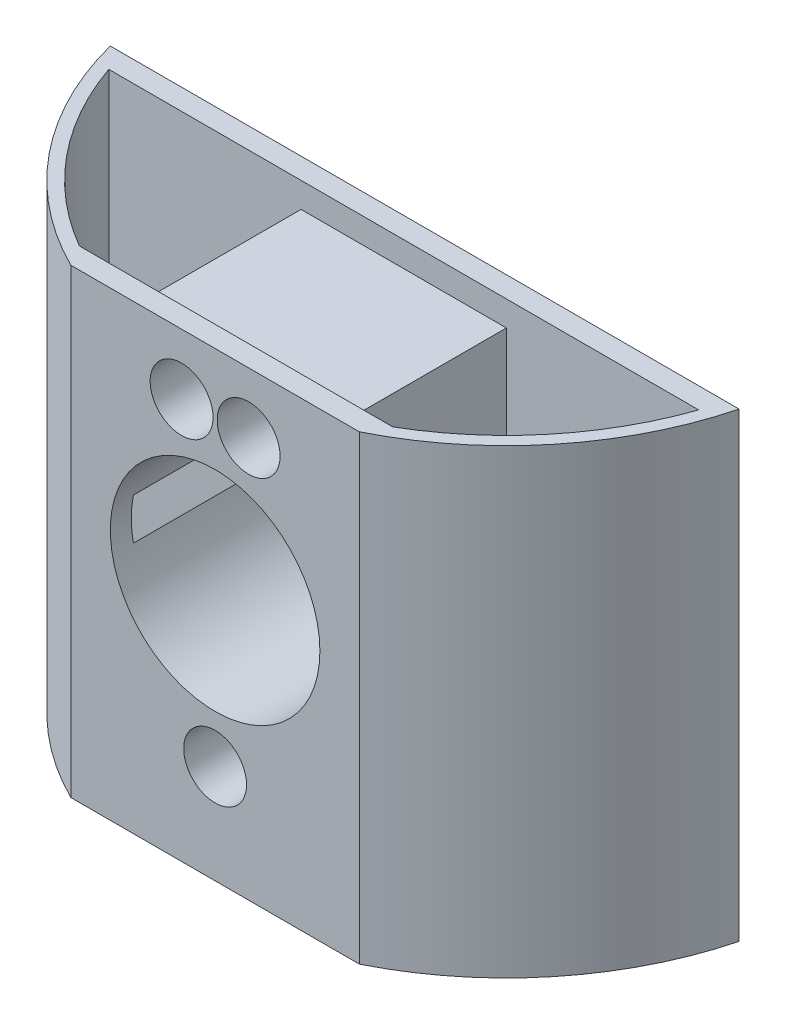
ISO-10303-21;
HEADER;
FILE_DESCRIPTION(('STEP AP214'),'2;1');
FILE_NAME('part.step','',(''),(''),'','','');
FILE_SCHEMA(('AUTOMOTIVE_DESIGN { 1 0 10303 214 1 1 1 1 }'));
ENDSEC;
DATA;
#1=APPLICATION_CONTEXT('core data for automotive mechanical design processes');
#2=APPLICATION_PROTOCOL_DEFINITION('international standard','automotive_design',2000,#1);
#3=PRODUCT_CONTEXT('',#1,'mechanical');
#4=PRODUCT('Part','Part','',(#3));
#5=PRODUCT_RELATED_PRODUCT_CATEGORY('part','',(#4));
#6=PRODUCT_DEFINITION_FORMATION('','',#4);
#7=PRODUCT_DEFINITION_CONTEXT('part definition',#1,'design');
#8=PRODUCT_DEFINITION('design','',#6,#7);
#9=PRODUCT_DEFINITION_SHAPE('','',#8);
#10=(LENGTH_UNIT() NAMED_UNIT(*) SI_UNIT(.MILLI.,.METRE.));
#11=(NAMED_UNIT(*) PLANE_ANGLE_UNIT() SI_UNIT($,.RADIAN.));
#12=(NAMED_UNIT(*) SI_UNIT($,.STERADIAN.) SOLID_ANGLE_UNIT());
#13=UNCERTAINTY_MEASURE_WITH_UNIT(LENGTH_MEASURE(1.E-05),#10,'distance_accuracy_value','');
#14=(GEOMETRIC_REPRESENTATION_CONTEXT(3) GLOBAL_UNCERTAINTY_ASSIGNED_CONTEXT((#13)) GLOBAL_UNIT_ASSIGNED_CONTEXT((#10,
#11,#12)) REPRESENTATION_CONTEXT('',''));
#15=CARTESIAN_POINT('',(0.,0.,0.));
#16=DIRECTION('',(0.,0.,1.));
#17=DIRECTION('',(1.,0.,0.));
#18=AXIS2_PLACEMENT_3D('',#15,#16,#17);
#19=CARTESIAN_POINT('',(0.,31.75,0.));
#20=DIRECTION('',(0.,1.,0.));
#21=DIRECTION('',(-1.,0.,0.));
#22=AXIS2_PLACEMENT_3D('',#19,#20,#21);
#23=PLANE('',#22);
#24=CARTESIAN_POINT('',(0.,31.75,-12.3444));
#25=DIRECTION('',(0.,1.,0.));
#26=DIRECTION('',(-1.,0.,0.));
#27=AXIS2_PLACEMENT_3D('',#24,#25,#26);
#28=CIRCLE('',#27,49.2125);
#29=CARTESIAN_POINT('',(-21.853009973228,31.75,31.75));
#30=VERTEX_POINT('',#29);
#31=CARTESIAN_POINT('',(-47.6391219995709,31.75,0.));
#32=VERTEX_POINT('',#31);
#33=EDGE_CURVE('E249',#30,#32,#28,.F.);
#34=ORIENTED_EDGE('',*,*,#33,.F.);
#35=DIRECTION('',(-1.,0.,0.));
#36=VECTOR('',#35,1.);
#37=CARTESIAN_POINT('',(0.,31.75,31.75));
#38=LINE('',#37,#36);
#39=CARTESIAN_POINT('',(21.853009973228,31.75,31.75));
#40=VERTEX_POINT('',#39);
#41=EDGE_CURVE('E293',#40,#30,#38,.T.);
#42=ORIENTED_EDGE('',*,*,#41,.F.);
#43=CARTESIAN_POINT('',(0.,31.75,-12.3444));
#44=DIRECTION('',(0.,1.,0.));
#45=DIRECTION('',(-1.,0.,0.));
#46=AXIS2_PLACEMENT_3D('',#43,#44,#45);
#47=CIRCLE('',#46,49.2125);
#48=CARTESIAN_POINT('',(47.6391219995709,31.75,0.));
#49=VERTEX_POINT('',#48);
#50=EDGE_CURVE('E240',#40,#49,#47,.T.);
#51=ORIENTED_EDGE('',*,*,#50,.T.);
#52=DIRECTION('',(-1.,0.,0.));
#53=VECTOR('',#52,1.);
#54=CARTESIAN_POINT('',(0.,31.75,0.));
#55=LINE('',#54,#53);
#56=EDGE_CURVE('E297',#49,#32,#55,.T.);
#57=ORIENTED_EDGE('',*,*,#56,.T.);
#58=EDGE_LOOP('',(#34,#42,#51,#57));
#59=FACE_BOUND('',#58,.T.);
#60=DIRECTION('',(-1.,0.,0.));
#61=VECTOR('',#60,1.);
#62=CARTESIAN_POINT('',(-44.6894593823868,31.75,3.175));
#63=LINE('',#62,#61);
#64=CARTESIAN_POINT('',(44.6894593823868,31.75,3.175));
#65=VERTEX_POINT('',#64);
#66=CARTESIAN_POINT('',(-44.6894593823868,31.75,3.175));
#67=VERTEX_POINT('',#66);
#68=EDGE_CURVE('E219',#65,#67,#63,.T.);
#69=ORIENTED_EDGE('',*,*,#68,.F.);
#70=CARTESIAN_POINT('',(0.,31.75,-12.3444));
#71=DIRECTION('',(0.,-1.,0.));
#72=DIRECTION('',(-1.,0.,0.));
#73=AXIS2_PLACEMENT_3D('',#70,#71,#72);
#74=CIRCLE('',#73,47.3075);
#75=CARTESIAN_POINT('',(23.7403087572593,31.75,28.575));
#76=VERTEX_POINT('',#75);
#77=EDGE_CURVE('E165',#65,#76,#74,.T.);
#78=ORIENTED_EDGE('',*,*,#77,.T.);
#79=DIRECTION('',(1.,0.,0.));
#80=VECTOR('',#79,1.);
#81=CARTESIAN_POINT('',(-15.5575,31.75,28.575));
#82=LINE('',#81,#80);
#83=CARTESIAN_POINT('',(-23.7403087572593,31.75,28.575));
#84=VERTEX_POINT('',#83);
#85=EDGE_CURVE('E58',#84,#76,#82,.T.);
#86=ORIENTED_EDGE('',*,*,#85,.F.);
#87=CARTESIAN_POINT('',(0.,31.75,-12.3444));
#88=DIRECTION('',(0.,1.,0.));
#89=DIRECTION('',(1.,0.,0.));
#90=AXIS2_PLACEMENT_3D('',#87,#88,#89);
#91=CIRCLE('',#90,47.3075);
#92=EDGE_CURVE('E213',#67,#84,#91,.T.);
#93=ORIENTED_EDGE('',*,*,#92,.F.);
#94=EDGE_LOOP('',(#69,#78,#86,#93));
#95=FACE_BOUND('',#94,.T.);
#96=ADVANCED_FACE('F42',(#59,#95),#23,.T.);
#97=CARTESIAN_POINT('',(-15.5575,-76.7501107043309,3.175));
#98=DIRECTION('',(1.,0.,0.));
#99=DIRECTION('',(0.,1.,0.));
#100=AXIS2_PLACEMENT_3D('',#97,#98,#99);
#101=PLANE('',#100);
#102=DIRECTION('',(0.,0.,-1.));
#103=VECTOR('',#102,1.);
#104=CARTESIAN_POINT('',(-15.5575,27.94,59.9223974198816));
#105=LINE('',#104,#103);
#106=CARTESIAN_POINT('',(-15.5575,27.94,28.575));
#107=VERTEX_POINT('',#106);
#108=CARTESIAN_POINT('',(-15.5575,27.94,3.175));
#109=VERTEX_POINT('',#108);
#110=EDGE_CURVE('E161',#107,#109,#105,.T.);
#111=ORIENTED_EDGE('',*,*,#110,.T.);
#112=DIRECTION('',(0.,1.,0.));
#113=VECTOR('',#112,1.);
#114=CARTESIAN_POINT('',(-15.5575,-76.7501107043309,3.175));
#115=LINE('',#114,#113);
#116=CARTESIAN_POINT('',(-15.5575,3.15908511281351,3.175));
#117=VERTEX_POINT('',#116);
#118=EDGE_CURVE('E230',#117,#109,#115,.T.);
#119=ORIENTED_EDGE('',*,*,#118,.F.);
#120=DIRECTION('',(0.,0.,1.));
#121=VECTOR('',#120,1.);
#122=CARTESIAN_POINT('',(-15.5575,3.15908511281352,0.));
#123=LINE('',#122,#121);
#124=CARTESIAN_POINT('',(-15.5575,3.15908511281353,28.575));
#125=VERTEX_POINT('',#124);
#126=EDGE_CURVE('E322',#125,#117,#123,.F.);
#127=ORIENTED_EDGE('',*,*,#126,.F.);
#128=DIRECTION('',(0.,1.,0.));
#129=VECTOR('',#128,1.);
#130=CARTESIAN_POINT('',(-15.5575,-76.7501107043309,28.575));
#131=LINE('',#130,#129);
#132=EDGE_CURVE('E235',#125,#107,#131,.T.);
#133=ORIENTED_EDGE('',*,*,#132,.T.);
#134=EDGE_LOOP('',(#111,#119,#127,#133));
#135=FACE_BOUND('',#134,.T.);
#136=ADVANCED_FACE('F377',(#135),#101,.F.);
#137=CARTESIAN_POINT('',(15.5575,-76.7501107043309,3.175));
#138=DIRECTION('',(1.,0.,0.));
#139=DIRECTION('',(0.,1.,0.));
#140=AXIS2_PLACEMENT_3D('',#137,#138,#139);
#141=PLANE('',#140);
#142=DIRECTION('',(0.,1.,0.));
#143=VECTOR('',#142,1.);
#144=CARTESIAN_POINT('',(15.5575,-76.7501107043309,3.175));
#145=LINE('',#144,#143);
#146=CARTESIAN_POINT('',(15.5575,3.1590851128135,3.175));
#147=VERTEX_POINT('',#146);
#148=CARTESIAN_POINT('',(15.5575,27.94,3.175));
#149=VERTEX_POINT('',#148);
#150=EDGE_CURVE('E174',#147,#149,#145,.T.);
#151=ORIENTED_EDGE('',*,*,#150,.T.);
#152=DIRECTION('',(0.,0.,-1.));
#153=VECTOR('',#152,1.);
#154=CARTESIAN_POINT('',(15.5575,27.94,59.9223974198816));
#155=LINE('',#154,#153);
#156=CARTESIAN_POINT('',(15.5575,27.94,28.575));
#157=VERTEX_POINT('',#156);
#158=EDGE_CURVE('E158',#157,#149,#155,.T.);
#159=ORIENTED_EDGE('',*,*,#158,.F.);
#160=DIRECTION('',(0.,1.,0.));
#161=VECTOR('',#160,1.);
#162=CARTESIAN_POINT('',(15.5575,-76.7501107043309,28.575));
#163=LINE('',#162,#161);
#164=CARTESIAN_POINT('',(15.5575,3.15908511281355,28.575));
#165=VERTEX_POINT('',#164);
#166=EDGE_CURVE('E171',#165,#157,#163,.T.);
#167=ORIENTED_EDGE('',*,*,#166,.F.);
#168=DIRECTION('',(0.,0.,1.));
#169=VECTOR('',#168,1.);
#170=CARTESIAN_POINT('',(15.5575,3.15908511281353,0.));
#171=LINE('',#170,#169);
#172=EDGE_CURVE('E51',#165,#147,#171,.F.);
#173=ORIENTED_EDGE('',*,*,#172,.T.);
#174=EDGE_LOOP('',(#151,#159,#167,#173));
#175=FACE_BOUND('',#174,.T.);
#176=ADVANCED_FACE('F170',(#175),#141,.T.);
#177=CARTESIAN_POINT('',(0.,0.,0.));
#178=DIRECTION('',(0.,0.,1.));
#179=DIRECTION('',(1.,0.,0.));
#180=AXIS2_PLACEMENT_3D('',#177,#178,#179);
#181=CYLINDRICAL_SURFACE('',#180,15.875);
#182=CARTESIAN_POINT('',(0.,0.,31.75));
#183=DIRECTION('',(0.,0.,1.));
#184=DIRECTION('',(1.,0.,0.));
#185=AXIS2_PLACEMENT_3D('',#182,#183,#184);
#186=CIRCLE('',#185,15.875);
#187=CARTESIAN_POINT('',(15.875,0.,31.75));
#188=VERTEX_POINT('',#187);
#189=EDGE_CURVE('E274',#188,#188,#186,.T.);
#190=ORIENTED_EDGE('',*,*,#189,.T.);
#191=EDGE_LOOP('',(#190));
#192=FACE_BOUND('',#191,.T.);
#193=CARTESIAN_POINT('',(0.,0.,0.));
#194=DIRECTION('',(0.,0.,1.));
#195=DIRECTION('',(1.,0.,0.));
#196=AXIS2_PLACEMENT_3D('',#193,#194,#195);
#197=CIRCLE('',#196,15.875);
#198=CARTESIAN_POINT('',(15.875,0.,0.));
#199=VERTEX_POINT('',#198);
#200=EDGE_CURVE('E254',#199,#199,#197,.T.);
#201=ORIENTED_EDGE('',*,*,#200,.F.);
#202=EDGE_LOOP('',(#201));
#203=FACE_BOUND('',#202,.T.);
#204=ORIENTED_EDGE('',*,*,#126,.T.);
#205=CARTESIAN_POINT('',(0.,0.,3.175));
#206=DIRECTION('',(0.,0.,-1.));
#207=DIRECTION('',(-1.,0.,0.));
#208=AXIS2_PLACEMENT_3D('',#205,#206,#207);
#209=CIRCLE('',#208,15.875);
#210=CARTESIAN_POINT('',(-15.5575,-3.15908511281353,3.175));
#211=VERTEX_POINT('',#210);
#212=EDGE_CURVE('E326',#117,#211,#209,.F.);
#213=ORIENTED_EDGE('',*,*,#212,.T.);
#214=DIRECTION('',(0.,0.,1.));
#215=VECTOR('',#214,1.);
#216=CARTESIAN_POINT('',(-15.5575,-3.15908511281352,0.));
#217=LINE('',#216,#215);
#218=CARTESIAN_POINT('',(-15.5575,-3.15908511281354,28.575));
#219=VERTEX_POINT('',#218);
#220=EDGE_CURVE('E318',#211,#219,#217,.T.);
#221=ORIENTED_EDGE('',*,*,#220,.T.);
#222=CARTESIAN_POINT('',(0.,0.,28.575));
#223=DIRECTION('',(0.,0.,1.));
#224=DIRECTION('',(1.,0.,0.));
#225=AXIS2_PLACEMENT_3D('',#222,#223,#224);
#226=CIRCLE('',#225,15.875);
#227=EDGE_CURVE('E314',#219,#125,#226,.F.);
#228=ORIENTED_EDGE('',*,*,#227,.T.);
#229=EDGE_LOOP('',(#204,#213,#221,#228));
#230=FACE_BOUND('',#229,.T.);
#231=CARTESIAN_POINT('',(0.,0.,3.175));
#232=DIRECTION('',(0.,0.,1.));
#233=DIRECTION('',(1.,0.,0.));
#234=AXIS2_PLACEMENT_3D('',#231,#232,#233);
#235=CIRCLE('',#234,15.875);
#236=CARTESIAN_POINT('',(15.5575,-3.15908511281357,3.175));
#237=VERTEX_POINT('',#236);
#238=EDGE_CURVE('E13',#147,#237,#235,.F.);
#239=ORIENTED_EDGE('',*,*,#238,.F.);
#240=ORIENTED_EDGE('',*,*,#172,.F.);
#241=CARTESIAN_POINT('',(0.,0.,28.575));
#242=DIRECTION('',(0.,0.,-1.));
#243=DIRECTION('',(-1.,0.,0.));
#244=AXIS2_PLACEMENT_3D('',#241,#242,#243);
#245=CIRCLE('',#244,15.875);
#246=CARTESIAN_POINT('',(15.5575,-3.15908511281356,28.575));
#247=VERTEX_POINT('',#246);
#248=EDGE_CURVE('E181',#247,#165,#245,.F.);
#249=ORIENTED_EDGE('',*,*,#248,.F.);
#250=DIRECTION('',(0.,0.,1.));
#251=VECTOR('',#250,1.);
#252=CARTESIAN_POINT('',(15.5575,-3.15908511281354,0.));
#253=LINE('',#252,#251);
#254=EDGE_CURVE('E332',#237,#247,#253,.T.);
#255=ORIENTED_EDGE('',*,*,#254,.F.);
#256=EDGE_LOOP('',(#239,#240,#249,#255));
#257=FACE_BOUND('',#256,.T.);
#258=ADVANCED_FACE('F343',(#192,#203,#230,#257),#181,.F.);
#259=CARTESIAN_POINT('',(0.,0.,31.75));
#260=DIRECTION('',(0.,0.,1.));
#261=DIRECTION('',(1.,0.,0.));
#262=AXIS2_PLACEMENT_3D('',#259,#260,#261);
#263=PLANE('',#262);
#264=ORIENTED_EDGE('',*,*,#189,.F.);
#265=EDGE_LOOP('',(#264));
#266=FACE_BOUND('',#265,.T.);
#267=CARTESIAN_POINT('',(0.,-23.114,31.75));
#268=DIRECTION('',(0.,0.,1.));
#269=DIRECTION('',(1.,0.,0.));
#270=AXIS2_PLACEMENT_3D('',#267,#268,#269);
#271=CIRCLE('',#270,4.7625);
#272=CARTESIAN_POINT('',(4.7625,-23.114,31.75));
#273=VERTEX_POINT('',#272);
#274=EDGE_CURVE('E267',#273,#273,#271,.T.);
#275=ORIENTED_EDGE('',*,*,#274,.F.);
#276=EDGE_LOOP('',(#275));
#277=FACE_BOUND('',#276,.T.);
#278=CARTESIAN_POINT('',(-5.08,22.5488491058857,31.75));
#279=DIRECTION('',(0.,0.,1.));
#280=DIRECTION('',(1.,0.,0.));
#281=AXIS2_PLACEMENT_3D('',#278,#279,#280);
#282=CIRCLE('',#281,4.7625);
#283=CARTESIAN_POINT('',(-0.317500000000002,22.5488491058857,31.75));
#284=VERTEX_POINT('',#283);
#285=EDGE_CURVE('E259',#284,#284,#282,.T.);
#286=ORIENTED_EDGE('',*,*,#285,.F.);
#287=EDGE_LOOP('',(#286));
#288=FACE_BOUND('',#287,.T.);
#289=CARTESIAN_POINT('',(5.08,22.5488491058857,31.75));
#290=DIRECTION('',(0.,0.,1.));
#291=DIRECTION('',(1.,0.,0.));
#292=AXIS2_PLACEMENT_3D('',#289,#290,#291);
#293=CIRCLE('',#292,4.7625);
#294=CARTESIAN_POINT('',(9.8425,22.5488491058857,31.75));
#295=VERTEX_POINT('',#294);
#296=EDGE_CURVE('E250',#295,#295,#293,.T.);
#297=ORIENTED_EDGE('',*,*,#296,.F.);
#298=EDGE_LOOP('',(#297));
#299=FACE_BOUND('',#298,.T.);
#300=DIRECTION('',(0.,1.,0.));
#301=VECTOR('',#300,1.);
#302=CARTESIAN_POINT('',(21.853009973228,-38.1000000000001,31.75));
#303=LINE('',#302,#301);
#304=CARTESIAN_POINT('',(21.853009973228,-38.1000000000001,31.75));
#305=VERTEX_POINT('',#304);
#306=EDGE_CURVE('E289',#305,#40,#303,.T.);
#307=ORIENTED_EDGE('',*,*,#306,.T.);
#308=ORIENTED_EDGE('',*,*,#41,.T.);
#309=DIRECTION('',(0.,1.,0.));
#310=VECTOR('',#309,1.);
#311=CARTESIAN_POINT('',(-21.853009973228,-38.1,31.75));
#312=LINE('',#311,#310);
#313=CARTESIAN_POINT('',(-21.853009973228,-38.1,31.75));
#314=VERTEX_POINT('',#313);
#315=EDGE_CURVE('E285',#314,#30,#312,.T.);
#316=ORIENTED_EDGE('',*,*,#315,.F.);
#317=DIRECTION('',(1.,0.,0.));
#318=VECTOR('',#317,1.);
#319=CARTESIAN_POINT('',(41.275,-38.1,31.75));
#320=LINE('',#319,#318);
#321=EDGE_CURVE('E245',#314,#305,#320,.T.);
#322=ORIENTED_EDGE('',*,*,#321,.T.);
#323=EDGE_LOOP('',(#307,#308,#316,#322));
#324=FACE_BOUND('',#323,.T.);
#325=ADVANCED_FACE('F412',(#266,#277,#288,#299,#324),#263,.T.);
#326=CARTESIAN_POINT('',(0.,0.,0.));
#327=DIRECTION('',(0.,0.,1.));
#328=DIRECTION('',(1.,0.,0.));
#329=AXIS2_PLACEMENT_3D('',#326,#327,#328);
#330=PLANE('',#329);
#331=CARTESIAN_POINT('',(5.08,22.5488491058857,0.));
#332=DIRECTION('',(0.,0.,1.));
#333=DIRECTION('',(1.,0.,0.));
#334=AXIS2_PLACEMENT_3D('',#331,#332,#333);
#335=CIRCLE('',#334,4.7625);
#336=CARTESIAN_POINT('',(9.8425,22.5488491058857,0.));
#337=VERTEX_POINT('',#336);
#338=EDGE_CURVE('E255',#337,#337,#335,.T.);
#339=ORIENTED_EDGE('',*,*,#338,.T.);
#340=EDGE_LOOP('',(#339));
#341=FACE_BOUND('',#340,.T.);
#342=CARTESIAN_POINT('',(-5.08,22.5488491058857,0.));
#343=DIRECTION('',(0.,0.,1.));
#344=DIRECTION('',(1.,0.,0.));
#345=AXIS2_PLACEMENT_3D('',#342,#343,#344);
#346=CIRCLE('',#345,4.7625);
#347=CARTESIAN_POINT('',(-0.317500000000002,22.5488491058857,0.));
#348=VERTEX_POINT('',#347);
#349=EDGE_CURVE('E263',#348,#348,#346,.T.);
#350=ORIENTED_EDGE('',*,*,#349,.T.);
#351=EDGE_LOOP('',(#350));
#352=FACE_BOUND('',#351,.T.);
#353=CARTESIAN_POINT('',(0.,-23.114,0.));
#354=DIRECTION('',(0.,0.,1.));
#355=DIRECTION('',(1.,0.,0.));
#356=AXIS2_PLACEMENT_3D('',#353,#354,#355);
#357=CIRCLE('',#356,4.7625);
#358=CARTESIAN_POINT('',(4.7625,-23.114,0.));
#359=VERTEX_POINT('',#358);
#360=EDGE_CURVE('E244',#359,#359,#357,.T.);
#361=ORIENTED_EDGE('',*,*,#360,.T.);
#362=EDGE_LOOP('',(#361));
#363=FACE_BOUND('',#362,.T.);
#364=ORIENTED_EDGE('',*,*,#200,.T.);
#365=EDGE_LOOP('',(#364));
#366=FACE_BOUND('',#365,.T.);
#367=ORIENTED_EDGE('',*,*,#56,.F.);
#368=DIRECTION('',(0.,1.,0.));
#369=VECTOR('',#368,1.);
#370=CARTESIAN_POINT('',(47.6391219995709,-38.1,0.));
#371=LINE('',#370,#369);
#372=CARTESIAN_POINT('',(47.6391219995709,-38.1,0.));
#373=VERTEX_POINT('',#372);
#374=EDGE_CURVE('E290',#373,#49,#371,.T.);
#375=ORIENTED_EDGE('',*,*,#374,.F.);
#376=DIRECTION('',(1.,0.,0.));
#377=VECTOR('',#376,1.);
#378=CARTESIAN_POINT('',(41.275,-38.1,0.));
#379=LINE('',#378,#377);
#380=CARTESIAN_POINT('',(-47.6391219995709,-38.1,0.));
#381=VERTEX_POINT('',#380);
#382=EDGE_CURVE('E241',#381,#373,#379,.T.);
#383=ORIENTED_EDGE('',*,*,#382,.F.);
#384=DIRECTION('',(0.,1.,0.));
#385=VECTOR('',#384,1.);
#386=CARTESIAN_POINT('',(-47.6391219995709,-38.1,0.));
#387=LINE('',#386,#385);
#388=EDGE_CURVE('E278',#381,#32,#387,.T.);
#389=ORIENTED_EDGE('',*,*,#388,.T.);
#390=EDGE_LOOP('',(#367,#375,#383,#389));
#391=FACE_BOUND('',#390,.T.);
#392=ADVANCED_FACE('F409',(#341,#352,#363,#366,#391),#330,.F.);
#393=CARTESIAN_POINT('',(0.,-38.1,-12.3444));
#394=DIRECTION('',(0.,1.,0.));
#395=DIRECTION('',(-1.,0.,0.));
#396=AXIS2_PLACEMENT_3D('',#393,#394,#395);
#397=CYLINDRICAL_SURFACE('',#396,49.2125);
#398=ORIENTED_EDGE('',*,*,#315,.T.);
#399=ORIENTED_EDGE('',*,*,#33,.T.);
#400=ORIENTED_EDGE('',*,*,#388,.F.);
#401=CARTESIAN_POINT('',(0.,-38.1,-12.3444));
#402=DIRECTION('',(0.,1.,0.));
#403=DIRECTION('',(-1.,0.,0.));
#404=AXIS2_PLACEMENT_3D('',#401,#402,#403);
#405=CIRCLE('',#404,49.2125);
#406=EDGE_CURVE('E282',#381,#314,#405,.T.);
#407=ORIENTED_EDGE('',*,*,#406,.T.);
#408=EDGE_LOOP('',(#398,#399,#400,#407));
#409=FACE_BOUND('',#408,.T.);
#410=ADVANCED_FACE('F44',(#409),#397,.T.);
#411=CARTESIAN_POINT('',(0.,-38.1,-12.3444));
#412=DIRECTION('',(0.,1.,0.));
#413=DIRECTION('',(-1.,0.,0.));
#414=AXIS2_PLACEMENT_3D('',#411,#412,#413);
#415=CYLINDRICAL_SURFACE('',#414,49.2125);
#416=ORIENTED_EDGE('',*,*,#50,.F.);
#417=ORIENTED_EDGE('',*,*,#306,.F.);
#418=CARTESIAN_POINT('',(0.,-38.1,-12.3444));
#419=DIRECTION('',(0.,-1.,0.));
#420=DIRECTION('',(1.,0.,0.));
#421=AXIS2_PLACEMENT_3D('',#418,#419,#420);
#422=CIRCLE('',#421,49.2125);
#423=EDGE_CURVE('E286',#373,#305,#422,.T.);
#424=ORIENTED_EDGE('',*,*,#423,.F.);
#425=ORIENTED_EDGE('',*,*,#374,.T.);
#426=EDGE_LOOP('',(#416,#417,#424,#425));
#427=FACE_BOUND('',#426,.T.);
#428=ADVANCED_FACE('F416',(#427),#415,.T.);
#429=CARTESIAN_POINT('',(41.275,-38.1,31.75));
#430=DIRECTION('',(0.,1.,0.));
#431=DIRECTION('',(-1.,0.,0.));
#432=AXIS2_PLACEMENT_3D('',#429,#430,#431);
#433=PLANE('',#432);
#434=ORIENTED_EDGE('',*,*,#423,.T.);
#435=ORIENTED_EDGE('',*,*,#321,.F.);
#436=ORIENTED_EDGE('',*,*,#406,.F.);
#437=ORIENTED_EDGE('',*,*,#382,.T.);
#438=EDGE_LOOP('',(#434,#435,#436,#437));
#439=FACE_BOUND('',#438,.T.);
#440=ADVANCED_FACE('F418',(#439),#433,.F.);
#441=CARTESIAN_POINT('',(5.08,22.5488491058857,0.));
#442=DIRECTION('',(0.,0.,1.));
#443=DIRECTION('',(1.,0.,0.));
#444=AXIS2_PLACEMENT_3D('',#441,#442,#443);
#445=CYLINDRICAL_SURFACE('',#444,4.7625);
#446=ORIENTED_EDGE('',*,*,#338,.F.);
#447=EDGE_LOOP('',(#446));
#448=FACE_BOUND('',#447,.T.);
#449=ORIENTED_EDGE('',*,*,#296,.T.);
#450=EDGE_LOOP('',(#449));
#451=FACE_BOUND('',#450,.T.);
#452=ADVANCED_FACE('F424',(#448,#451),#445,.F.);
#453=CARTESIAN_POINT('',(-5.08,22.5488491058857,0.));
#454=DIRECTION('',(0.,0.,1.));
#455=DIRECTION('',(1.,0.,0.));
#456=AXIS2_PLACEMENT_3D('',#453,#454,#455);
#457=CYLINDRICAL_SURFACE('',#456,4.7625);
#458=ORIENTED_EDGE('',*,*,#349,.F.);
#459=EDGE_LOOP('',(#458));
#460=FACE_BOUND('',#459,.T.);
#461=ORIENTED_EDGE('',*,*,#285,.T.);
#462=EDGE_LOOP('',(#461));
#463=FACE_BOUND('',#462,.T.);
#464=ADVANCED_FACE('F535',(#460,#463),#457,.F.);
#465=CARTESIAN_POINT('',(0.,-23.114,0.));
#466=DIRECTION('',(0.,0.,1.));
#467=DIRECTION('',(1.,0.,0.));
#468=AXIS2_PLACEMENT_3D('',#465,#466,#467);
#469=CYLINDRICAL_SURFACE('',#468,4.7625);
#470=ORIENTED_EDGE('',*,*,#360,.F.);
#471=EDGE_LOOP('',(#470));
#472=FACE_BOUND('',#471,.T.);
#473=ORIENTED_EDGE('',*,*,#274,.T.);
#474=EDGE_LOOP('',(#473));
#475=FACE_BOUND('',#474,.T.);
#476=ADVANCED_FACE('F398',(#472,#475),#469,.F.);
#477=CARTESIAN_POINT('',(-44.6894593823868,-76.7501107043309,3.175));
#478=DIRECTION('',(0.,0.,-1.));
#479=DIRECTION('',(-1.,0.,0.));
#480=AXIS2_PLACEMENT_3D('',#477,#478,#479);
#481=PLANE('',#480);
#482=ORIENTED_EDGE('',*,*,#118,.T.);
#483=DIRECTION('',(1.,0.,0.));
#484=VECTOR('',#483,1.);
#485=CARTESIAN_POINT('',(-15.5575,27.94,3.175));
#486=LINE('',#485,#484);
#487=EDGE_CURVE('E176',#109,#149,#486,.T.);
#488=ORIENTED_EDGE('',*,*,#487,.T.);
#489=ORIENTED_EDGE('',*,*,#150,.F.);
#490=ORIENTED_EDGE('',*,*,#238,.T.);
#491=CARTESIAN_POINT('',(15.5575,-30.48,3.175));
#492=VERTEX_POINT('',#491);
#493=EDGE_CURVE('E183',#492,#237,#145,.T.);
#494=ORIENTED_EDGE('',*,*,#493,.F.);
#495=DIRECTION('',(-1.,0.,0.));
#496=VECTOR('',#495,1.);
#497=CARTESIAN_POINT('',(44.6894593823868,-30.48,3.175));
#498=LINE('',#497,#496);
#499=CARTESIAN_POINT('',(44.6894593823868,-30.48,3.175));
#500=VERTEX_POINT('',#499);
#501=EDGE_CURVE('E197',#500,#492,#498,.T.);
#502=ORIENTED_EDGE('',*,*,#501,.F.);
#503=DIRECTION('',(0.,1.,0.));
#504=VECTOR('',#503,1.);
#505=CARTESIAN_POINT('',(44.6894593823868,-76.7501107043309,3.175));
#506=LINE('',#505,#504);
#507=EDGE_CURVE('E193',#500,#65,#506,.T.);
#508=ORIENTED_EDGE('',*,*,#507,.T.);
#509=ORIENTED_EDGE('',*,*,#68,.T.);
#510=DIRECTION('',(0.,1.,0.));
#511=VECTOR('',#510,1.);
#512=CARTESIAN_POINT('',(-44.6894593823868,-76.7501107043309,3.175));
#513=LINE('',#512,#511);
#514=CARTESIAN_POINT('',(-44.6894593823868,-30.48,3.175));
#515=VERTEX_POINT('',#514);
#516=EDGE_CURVE('E206',#515,#67,#513,.T.);
#517=ORIENTED_EDGE('',*,*,#516,.F.);
#518=DIRECTION('',(1.,0.,0.));
#519=VECTOR('',#518,1.);
#520=CARTESIAN_POINT('',(-44.6894593823868,-30.48,3.175));
#521=LINE('',#520,#519);
#522=CARTESIAN_POINT('',(-15.5575,-30.48,3.175));
#523=VERTEX_POINT('',#522);
#524=EDGE_CURVE('E205',#515,#523,#521,.T.);
#525=ORIENTED_EDGE('',*,*,#524,.T.);
#526=EDGE_CURVE('E226',#523,#211,#115,.T.);
#527=ORIENTED_EDGE('',*,*,#526,.T.);
#528=ORIENTED_EDGE('',*,*,#212,.F.);
#529=EDGE_LOOP('',(#482,#488,#489,#490,#494,#502,#508,#509,#517,#525,#527,#528));
#530=FACE_BOUND('',#529,.T.);
#531=ADVANCED_FACE('F339',(#530),#481,.F.);
#532=ORIENTED_EDGE('',*,*,#526,.F.);
#533=DIRECTION('',(0.,0.,1.));
#534=VECTOR('',#533,1.);
#535=CARTESIAN_POINT('',(-15.5575,-30.48,3.175));
#536=LINE('',#535,#534);
#537=CARTESIAN_POINT('',(-15.5575,-30.48,28.575));
#538=VERTEX_POINT('',#537);
#539=EDGE_CURVE('E202',#523,#538,#536,.T.);
#540=ORIENTED_EDGE('',*,*,#539,.T.);
#541=EDGE_CURVE('E231',#538,#219,#131,.T.);
#542=ORIENTED_EDGE('',*,*,#541,.T.);
#543=ORIENTED_EDGE('',*,*,#220,.F.);
#544=EDGE_LOOP('',(#532,#540,#542,#543));
#545=FACE_BOUND('',#544,.T.);
#546=ADVANCED_FACE('F390',(#545),#101,.F.);
#547=CARTESIAN_POINT('',(-15.5575,-76.7501107043309,28.575));
#548=DIRECTION('',(0.,0.,1.));
#549=DIRECTION('',(1.,0.,0.));
#550=AXIS2_PLACEMENT_3D('',#547,#548,#549);
#551=PLANE('',#550);
#552=ORIENTED_EDGE('',*,*,#541,.F.);
#553=DIRECTION('',(-1.,0.,0.));
#554=VECTOR('',#553,1.);
#555=CARTESIAN_POINT('',(-15.5575,-30.48,28.575));
#556=LINE('',#555,#554);
#557=CARTESIAN_POINT('',(-23.7403087572593,-30.48,28.575));
#558=VERTEX_POINT('',#557);
#559=EDGE_CURVE('E212',#538,#558,#556,.T.);
#560=ORIENTED_EDGE('',*,*,#559,.T.);
#561=DIRECTION('',(0.,1.,0.));
#562=VECTOR('',#561,1.);
#563=CARTESIAN_POINT('',(-23.7403087572592,-76.7501107043309,28.575));
#564=LINE('',#563,#562);
#565=EDGE_CURVE('E223',#558,#84,#564,.T.);
#566=ORIENTED_EDGE('',*,*,#565,.T.);
#567=ORIENTED_EDGE('',*,*,#85,.T.);
#568=DIRECTION('',(0.,1.,0.));
#569=VECTOR('',#568,1.);
#570=CARTESIAN_POINT('',(23.7403087572592,-76.7501107043309,28.575));
#571=LINE('',#570,#569);
#572=CARTESIAN_POINT('',(23.7403087572593,-30.48,28.575));
#573=VERTEX_POINT('',#572);
#574=EDGE_CURVE('E187',#573,#76,#571,.T.);
#575=ORIENTED_EDGE('',*,*,#574,.F.);
#576=DIRECTION('',(1.,0.,0.));
#577=VECTOR('',#576,1.);
#578=CARTESIAN_POINT('',(15.5575,-30.48,28.575));
#579=LINE('',#578,#577);
#580=CARTESIAN_POINT('',(15.5575,-30.48,28.575));
#581=VERTEX_POINT('',#580);
#582=EDGE_CURVE('E352',#581,#573,#579,.T.);
#583=ORIENTED_EDGE('',*,*,#582,.F.);
#584=EDGE_CURVE('E65',#581,#247,#163,.T.);
#585=ORIENTED_EDGE('',*,*,#584,.T.);
#586=ORIENTED_EDGE('',*,*,#248,.T.);
#587=ORIENTED_EDGE('',*,*,#166,.T.);
#588=DIRECTION('',(1.,0.,0.));
#589=VECTOR('',#588,1.);
#590=CARTESIAN_POINT('',(-15.5575,27.94,28.575));
#591=LINE('',#590,#589);
#592=EDGE_CURVE('E155',#107,#157,#591,.T.);
#593=ORIENTED_EDGE('',*,*,#592,.F.);
#594=ORIENTED_EDGE('',*,*,#132,.F.);
#595=ORIENTED_EDGE('',*,*,#227,.F.);
#596=EDGE_LOOP('',(#552,#560,#566,#567,#575,#583,#585,#586,#587,#593,#594,#595));
#597=FACE_BOUND('',#596,.T.);
#598=ADVANCED_FACE('F179',(#597),#551,.F.);
#599=CARTESIAN_POINT('',(0.,-76.7501107043309,-12.3444));
#600=DIRECTION('',(0.,1.,0.));
#601=DIRECTION('',(-1.,0.,0.));
#602=AXIS2_PLACEMENT_3D('',#599,#600,#601);
#603=CYLINDRICAL_SURFACE('',#602,47.3075);
#604=CARTESIAN_POINT('',(0.,-30.48,-12.3444));
#605=DIRECTION('',(0.,1.,0.));
#606=DIRECTION('',(-1.,0.,0.));
#607=AXIS2_PLACEMENT_3D('',#604,#605,#606);
#608=CIRCLE('',#607,47.3075);
#609=EDGE_CURVE('E209',#558,#515,#608,.F.);
#610=ORIENTED_EDGE('',*,*,#609,.T.);
#611=ORIENTED_EDGE('',*,*,#516,.T.);
#612=ORIENTED_EDGE('',*,*,#92,.T.);
#613=ORIENTED_EDGE('',*,*,#565,.F.);
#614=EDGE_LOOP('',(#610,#611,#612,#613));
#615=FACE_BOUND('',#614,.T.);
#616=ADVANCED_FACE('F364',(#615),#603,.F.);
#617=CARTESIAN_POINT('',(41.275,-30.48,31.75));
#618=DIRECTION('',(0.,1.,0.));
#619=DIRECTION('',(-1.,0.,0.));
#620=AXIS2_PLACEMENT_3D('',#617,#618,#619);
#621=PLANE('',#620);
#622=ORIENTED_EDGE('',*,*,#609,.F.);
#623=ORIENTED_EDGE('',*,*,#559,.F.);
#624=ORIENTED_EDGE('',*,*,#539,.F.);
#625=ORIENTED_EDGE('',*,*,#524,.F.);
#626=EDGE_LOOP('',(#622,#623,#624,#625));
#627=FACE_BOUND('',#626,.T.);
#628=ADVANCED_FACE('F370',(#627),#621,.T.);
#629=ORIENTED_EDGE('',*,*,#254,.T.);
#630=ORIENTED_EDGE('',*,*,#584,.F.);
#631=DIRECTION('',(0.,0.,1.));
#632=VECTOR('',#631,1.);
#633=CARTESIAN_POINT('',(15.5575,-30.48,3.175));
#634=LINE('',#633,#632);
#635=EDGE_CURVE('E201',#492,#581,#634,.T.);
#636=ORIENTED_EDGE('',*,*,#635,.F.);
#637=ORIENTED_EDGE('',*,*,#493,.T.);
#638=EDGE_LOOP('',(#629,#630,#636,#637));
#639=FACE_BOUND('',#638,.T.);
#640=ADVANCED_FACE('F345',(#639),#141,.T.);
#641=CARTESIAN_POINT('',(0.,-76.7501107043309,-12.3444));
#642=DIRECTION('',(0.,1.,0.));
#643=DIRECTION('',(-1.,0.,0.));
#644=AXIS2_PLACEMENT_3D('',#641,#642,#643);
#645=CYLINDRICAL_SURFACE('',#644,47.3075);
#646=ORIENTED_EDGE('',*,*,#574,.T.);
#647=ORIENTED_EDGE('',*,*,#77,.F.);
#648=ORIENTED_EDGE('',*,*,#507,.F.);
#649=CARTESIAN_POINT('',(0.,-30.48,-12.3444));
#650=DIRECTION('',(0.,1.,0.));
#651=DIRECTION('',(-1.,0.,0.));
#652=AXIS2_PLACEMENT_3D('',#649,#650,#651);
#653=CIRCLE('',#652,47.3075);
#654=EDGE_CURVE('E216',#573,#500,#653,.T.);
#655=ORIENTED_EDGE('',*,*,#654,.F.);
#656=EDGE_LOOP('',(#646,#647,#648,#655));
#657=FACE_BOUND('',#656,.T.);
#658=ADVANCED_FACE('F357',(#657),#645,.F.);
#659=CARTESIAN_POINT('',(41.275,-30.48,31.75));
#660=DIRECTION('',(0.,1.,0.));
#661=DIRECTION('',(-1.,0.,0.));
#662=AXIS2_PLACEMENT_3D('',#659,#660,#661);
#663=PLANE('',#662);
#664=ORIENTED_EDGE('',*,*,#582,.T.);
#665=ORIENTED_EDGE('',*,*,#654,.T.);
#666=ORIENTED_EDGE('',*,*,#501,.T.);
#667=ORIENTED_EDGE('',*,*,#635,.T.);
#668=EDGE_LOOP('',(#664,#665,#666,#667));
#669=FACE_BOUND('',#668,.T.);
#670=ADVANCED_FACE('F350',(#669),#663,.T.);
#671=CARTESIAN_POINT('',(-15.5575,27.94,59.9223974198816));
#672=DIRECTION('',(0.,1.,0.));
#673=DIRECTION('',(0.,0.,1.));
#674=AXIS2_PLACEMENT_3D('',#671,#672,#673);
#675=PLANE('',#674);
#676=ORIENTED_EDGE('',*,*,#592,.T.);
#677=ORIENTED_EDGE('',*,*,#158,.T.);
#678=ORIENTED_EDGE('',*,*,#487,.F.);
#679=ORIENTED_EDGE('',*,*,#110,.F.);
#680=EDGE_LOOP('',(#676,#677,#678,#679));
#681=FACE_BOUND('',#680,.T.);
#682=ADVANCED_FACE('F157',(#681),#675,.T.);
#683=CLOSED_SHELL('',(#96,#136,#176,#258,#325,#392,#410,#428,#440,#452,#464,#476,#531,#546,#598,
#616,#628,#640,#658,#670,#682));
#684=MANIFOLD_SOLID_BREP('B2',#683);
#685=ADVANCED_BREP_SHAPE_REPRESENTATION('',(#18,#684),#14);
#686=SHAPE_DEFINITION_REPRESENTATION(#9,#685);
ENDSEC;
END-ISO-10303-21;
